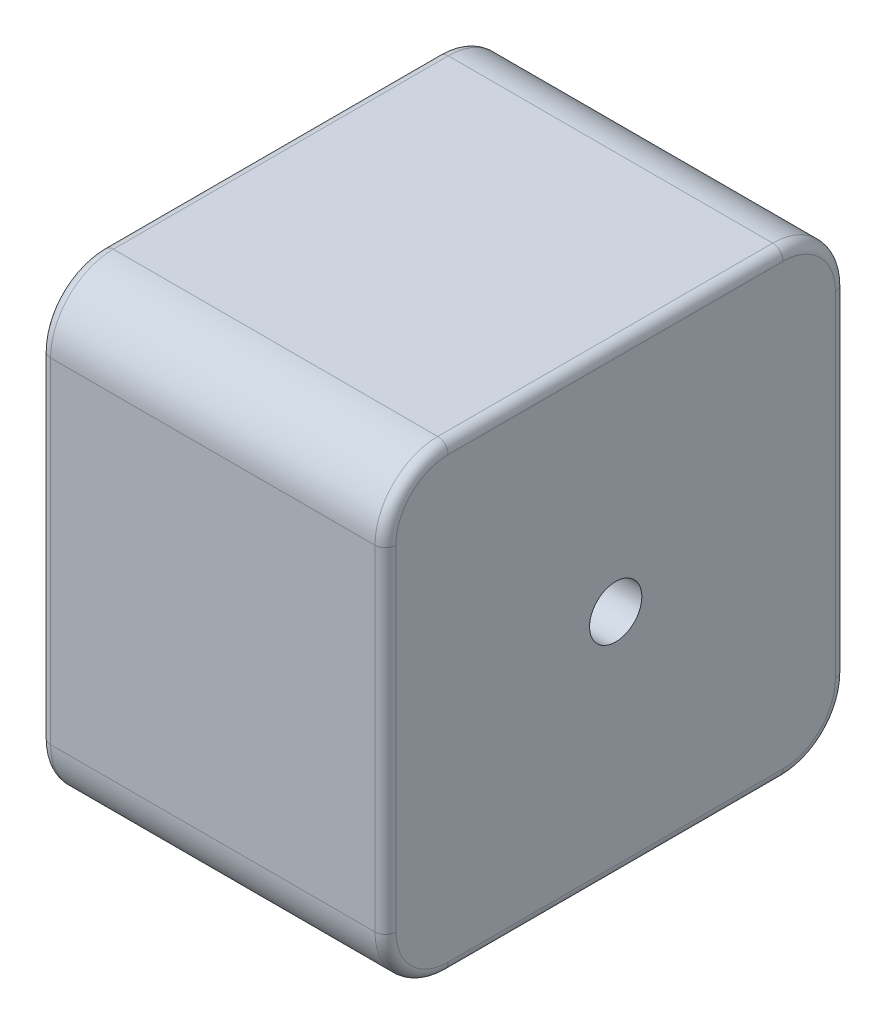
ISO-10303-21;
HEADER;
FILE_DESCRIPTION(('STEP AP214'),'2;1');
FILE_NAME('part.step','',(''),(''),'','','');
FILE_SCHEMA(('AUTOMOTIVE_DESIGN { 1 0 10303 214 1 1 1 1 }'));
ENDSEC;
DATA;
#1=APPLICATION_CONTEXT('core data for automotive mechanical design processes');
#2=APPLICATION_PROTOCOL_DEFINITION('international standard','automotive_design',2000,#1);
#3=PRODUCT_CONTEXT('',#1,'mechanical');
#4=PRODUCT('Part','Part','',(#3));
#5=PRODUCT_RELATED_PRODUCT_CATEGORY('part','',(#4));
#6=PRODUCT_DEFINITION_FORMATION('','',#4);
#7=PRODUCT_DEFINITION_CONTEXT('part definition',#1,'design');
#8=PRODUCT_DEFINITION('design','',#6,#7);
#9=PRODUCT_DEFINITION_SHAPE('','',#8);
#10=(LENGTH_UNIT() NAMED_UNIT(*) SI_UNIT(.MILLI.,.METRE.));
#11=(NAMED_UNIT(*) PLANE_ANGLE_UNIT() SI_UNIT($,.RADIAN.));
#12=(NAMED_UNIT(*) SI_UNIT($,.STERADIAN.) SOLID_ANGLE_UNIT());
#13=UNCERTAINTY_MEASURE_WITH_UNIT(LENGTH_MEASURE(1.E-05),#10,'distance_accuracy_value','');
#14=(GEOMETRIC_REPRESENTATION_CONTEXT(3) GLOBAL_UNCERTAINTY_ASSIGNED_CONTEXT((#13)) GLOBAL_UNIT_ASSIGNED_CONTEXT((#10,
#11,#12)) REPRESENTATION_CONTEXT('',''));
#15=CARTESIAN_POINT('',(0.,0.,0.));
#16=DIRECTION('',(0.,0.,1.));
#17=DIRECTION('',(1.,0.,0.));
#18=AXIS2_PLACEMENT_3D('',#15,#16,#17);
#19=CARTESIAN_POINT('',(33.,-16.,16.));
#20=DIRECTION('',(1.,0.,0.));
#21=DIRECTION('',(0.,0.,-1.));
#22=AXIS2_PLACEMENT_3D('',#19,#20,#21);
#23=PLANE('',#22);
#24=DIRECTION('',(0.,0.,1.));
#25=VECTOR('',#24,1.);
#26=CARTESIAN_POINT('',(33.,21.,16.));
#27=LINE('',#26,#25);
#28=CARTESIAN_POINT('',(33.,21.,-16.));
#29=VERTEX_POINT('',#28);
#30=CARTESIAN_POINT('',(33.,21.,16.));
#31=VERTEX_POINT('',#30);
#32=EDGE_CURVE('E268',#29,#31,#27,.T.);
#33=ORIENTED_EDGE('',*,*,#32,.T.);
#34=CARTESIAN_POINT('',(33.,16.,16.));
#35=DIRECTION('',(1.,0.,0.));
#36=DIRECTION('',(0.,0.,-1.));
#37=AXIS2_PLACEMENT_3D('',#34,#35,#36);
#38=CIRCLE('',#37,5.);
#39=CARTESIAN_POINT('',(33.,16.,21.));
#40=VERTEX_POINT('',#39);
#41=EDGE_CURVE('E247',#31,#40,#38,.T.);
#42=ORIENTED_EDGE('',*,*,#41,.T.);
#43=DIRECTION('',(0.,-1.,0.));
#44=VECTOR('',#43,1.);
#45=CARTESIAN_POINT('',(33.,-16.,21.));
#46=LINE('',#45,#44);
#47=CARTESIAN_POINT('',(33.,-16.,21.));
#48=VERTEX_POINT('',#47);
#49=EDGE_CURVE('E251',#40,#48,#46,.T.);
#50=ORIENTED_EDGE('',*,*,#49,.T.);
#51=CARTESIAN_POINT('',(33.,-16.,16.));
#52=DIRECTION('',(1.,0.,0.));
#53=DIRECTION('',(0.,0.,-1.));
#54=AXIS2_PLACEMENT_3D('',#51,#52,#53);
#55=CIRCLE('',#54,5.);
#56=CARTESIAN_POINT('',(33.,-21.,16.));
#57=VERTEX_POINT('',#56);
#58=EDGE_CURVE('E254',#48,#57,#55,.T.);
#59=ORIENTED_EDGE('',*,*,#58,.T.);
#60=DIRECTION('',(0.,0.,-1.));
#61=VECTOR('',#60,1.);
#62=CARTESIAN_POINT('',(33.,-21.,-16.));
#63=LINE('',#62,#61);
#64=CARTESIAN_POINT('',(33.,-21.,-16.));
#65=VERTEX_POINT('',#64);
#66=EDGE_CURVE('E257',#57,#65,#63,.T.);
#67=ORIENTED_EDGE('',*,*,#66,.T.);
#68=CARTESIAN_POINT('',(33.,-16.,-16.));
#69=DIRECTION('',(1.,0.,0.));
#70=DIRECTION('',(0.,0.,-1.));
#71=AXIS2_PLACEMENT_3D('',#68,#69,#70);
#72=CIRCLE('',#71,5.);
#73=CARTESIAN_POINT('',(33.,-16.,-21.));
#74=VERTEX_POINT('',#73);
#75=EDGE_CURVE('E260',#65,#74,#72,.T.);
#76=ORIENTED_EDGE('',*,*,#75,.T.);
#77=DIRECTION('',(0.,1.,0.));
#78=VECTOR('',#77,1.);
#79=CARTESIAN_POINT('',(33.,16.,-21.));
#80=LINE('',#79,#78);
#81=CARTESIAN_POINT('',(33.,16.,-21.));
#82=VERTEX_POINT('',#81);
#83=EDGE_CURVE('E263',#74,#82,#80,.T.);
#84=ORIENTED_EDGE('',*,*,#83,.T.);
#85=CARTESIAN_POINT('',(33.,16.,-16.));
#86=DIRECTION('',(1.,0.,0.));
#87=DIRECTION('',(0.,0.,-1.));
#88=AXIS2_PLACEMENT_3D('',#85,#86,#87);
#89=CIRCLE('',#88,5.);
#90=EDGE_CURVE('E188',#82,#29,#89,.T.);
#91=ORIENTED_EDGE('',*,*,#90,.T.);
#92=EDGE_LOOP('',(#33,#42,#50,#59,#67,#76,#84,#91));
#93=FACE_BOUND('',#92,.T.);
#94=CARTESIAN_POINT('',(33.,0.,0.));
#95=DIRECTION('',(1.,0.,0.));
#96=DIRECTION('',(0.,0.,-1.));
#97=AXIS2_PLACEMENT_3D('',#94,#95,#96);
#98=CIRCLE('',#97,2.5);
#99=CARTESIAN_POINT('',(33.,0.,-2.5));
#100=VERTEX_POINT('',#99);
#101=EDGE_CURVE('E352',#100,#100,#98,.T.);
#102=ORIENTED_EDGE('',*,*,#101,.F.);
#103=EDGE_LOOP('',(#102));
#104=FACE_BOUND('',#103,.T.);
#105=ADVANCED_FACE('F39',(#93,#104),#23,.T.);
#106=CARTESIAN_POINT('',(0.,-16.,16.));
#107=DIRECTION('',(1.,0.,0.));
#108=DIRECTION('',(0.,0.,-1.));
#109=AXIS2_PLACEMENT_3D('',#106,#107,#108);
#110=PLANE('',#109);
#111=CARTESIAN_POINT('',(0.,16.,-16.));
#112=DIRECTION('',(1.,0.,0.));
#113=DIRECTION('',(0.,0.,-1.));
#114=AXIS2_PLACEMENT_3D('',#111,#112,#113);
#115=CIRCLE('',#114,5.);
#116=CARTESIAN_POINT('',(0.,21.,-16.));
#117=VERTEX_POINT('',#116);
#118=CARTESIAN_POINT('',(0.,16.,-21.));
#119=VERTEX_POINT('',#118);
#120=EDGE_CURVE('E324',#117,#119,#115,.F.);
#121=ORIENTED_EDGE('',*,*,#120,.T.);
#122=DIRECTION('',(0.,1.,0.));
#123=VECTOR('',#122,1.);
#124=CARTESIAN_POINT('',(0.,-16.,-21.));
#125=LINE('',#124,#123);
#126=CARTESIAN_POINT('',(0.,-16.,-21.));
#127=VERTEX_POINT('',#126);
#128=EDGE_CURVE('E302',#119,#127,#125,.F.);
#129=ORIENTED_EDGE('',*,*,#128,.T.);
#130=CARTESIAN_POINT('',(0.,-16.,-16.));
#131=DIRECTION('',(1.,0.,0.));
#132=DIRECTION('',(0.,0.,-1.));
#133=AXIS2_PLACEMENT_3D('',#130,#131,#132);
#134=CIRCLE('',#133,5.);
#135=CARTESIAN_POINT('',(0.,-21.,-16.));
#136=VERTEX_POINT('',#135);
#137=EDGE_CURVE('E306',#127,#136,#134,.F.);
#138=ORIENTED_EDGE('',*,*,#137,.T.);
#139=DIRECTION('',(0.,0.,-1.));
#140=VECTOR('',#139,1.);
#141=CARTESIAN_POINT('',(0.,-21.,16.));
#142=LINE('',#141,#140);
#143=CARTESIAN_POINT('',(0.,-21.,16.));
#144=VERTEX_POINT('',#143);
#145=EDGE_CURVE('E309',#136,#144,#142,.F.);
#146=ORIENTED_EDGE('',*,*,#145,.T.);
#147=CARTESIAN_POINT('',(0.,-16.,16.));
#148=DIRECTION('',(1.,0.,0.));
#149=DIRECTION('',(0.,0.,-1.));
#150=AXIS2_PLACEMENT_3D('',#147,#148,#149);
#151=CIRCLE('',#150,5.);
#152=CARTESIAN_POINT('',(0.,-16.,21.));
#153=VERTEX_POINT('',#152);
#154=EDGE_CURVE('E312',#144,#153,#151,.F.);
#155=ORIENTED_EDGE('',*,*,#154,.T.);
#156=DIRECTION('',(0.,-1.,0.));
#157=VECTOR('',#156,1.);
#158=CARTESIAN_POINT('',(0.,-16.,21.));
#159=LINE('',#158,#157);
#160=CARTESIAN_POINT('',(0.,16.,21.));
#161=VERTEX_POINT('',#160);
#162=EDGE_CURVE('E315',#153,#161,#159,.F.);
#163=ORIENTED_EDGE('',*,*,#162,.T.);
#164=CARTESIAN_POINT('',(0.,16.,16.));
#165=DIRECTION('',(1.,0.,0.));
#166=DIRECTION('',(0.,0.,-1.));
#167=AXIS2_PLACEMENT_3D('',#164,#165,#166);
#168=CIRCLE('',#167,5.);
#169=CARTESIAN_POINT('',(0.,21.,16.));
#170=VERTEX_POINT('',#169);
#171=EDGE_CURVE('E318',#161,#170,#168,.F.);
#172=ORIENTED_EDGE('',*,*,#171,.T.);
#173=DIRECTION('',(0.,0.,1.));
#174=VECTOR('',#173,1.);
#175=CARTESIAN_POINT('',(0.,21.,16.));
#176=LINE('',#175,#174);
#177=EDGE_CURVE('E321',#170,#117,#176,.F.);
#178=ORIENTED_EDGE('',*,*,#177,.T.);
#179=EDGE_LOOP('',(#121,#129,#138,#146,#155,#163,#172,#178));
#180=FACE_BOUND('',#179,.T.);
#181=CARTESIAN_POINT('',(0.,0.,0.));
#182=DIRECTION('',(1.,0.,0.));
#183=DIRECTION('',(0.,0.,-1.));
#184=AXIS2_PLACEMENT_3D('',#181,#182,#183);
#185=CIRCLE('',#184,2.5);
#186=CARTESIAN_POINT('',(0.,0.,-2.5));
#187=VERTEX_POINT('',#186);
#188=EDGE_CURVE('E216',#187,#187,#185,.T.);
#189=ORIENTED_EDGE('',*,*,#188,.T.);
#190=EDGE_LOOP('',(#189));
#191=FACE_BOUND('',#190,.T.);
#192=ADVANCED_FACE('F364',(#180,#191),#110,.F.);
#193=CARTESIAN_POINT('',(33.,-16.,16.));
#194=DIRECTION('',(-1.,0.,0.));
#195=DIRECTION('',(0.,0.,1.));
#196=AXIS2_PLACEMENT_3D('',#193,#194,#195);
#197=CYLINDRICAL_SURFACE('',#196,6.);
#198=DIRECTION('',(-1.,0.,0.));
#199=VECTOR('',#198,1.);
#200=CARTESIAN_POINT('',(33.,-16.,22.));
#201=LINE('',#200,#199);
#202=CARTESIAN_POINT('',(32.,-16.,22.));
#203=VERTEX_POINT('',#202);
#204=CARTESIAN_POINT('',(1.,-16.,22.));
#205=VERTEX_POINT('',#204);
#206=EDGE_CURVE('E348',#203,#205,#201,.T.);
#207=ORIENTED_EDGE('',*,*,#206,.T.);
#208=CARTESIAN_POINT('',(1.,-16.,16.));
#209=DIRECTION('',(1.,0.,0.));
#210=DIRECTION('',(0.,0.,-1.));
#211=AXIS2_PLACEMENT_3D('',#208,#209,#210);
#212=CIRCLE('',#211,6.);
#213=CARTESIAN_POINT('',(1.,-22.,16.));
#214=VERTEX_POINT('',#213);
#215=EDGE_CURVE('E284',#205,#214,#212,.T.);
#216=ORIENTED_EDGE('',*,*,#215,.T.);
#217=DIRECTION('',(-1.,0.,0.));
#218=VECTOR('',#217,1.);
#219=CARTESIAN_POINT('',(33.,-22.,16.));
#220=LINE('',#219,#218);
#221=CARTESIAN_POINT('',(32.,-22.,16.));
#222=VERTEX_POINT('',#221);
#223=EDGE_CURVE('E185',#222,#214,#220,.T.);
#224=ORIENTED_EDGE('',*,*,#223,.F.);
#225=CARTESIAN_POINT('',(32.,-16.,16.));
#226=DIRECTION('',(1.,0.,0.));
#227=DIRECTION('',(0.,0.,-1.));
#228=AXIS2_PLACEMENT_3D('',#225,#226,#227);
#229=CIRCLE('',#228,6.);
#230=EDGE_CURVE('E287',#222,#203,#229,.F.);
#231=ORIENTED_EDGE('',*,*,#230,.T.);
#232=EDGE_LOOP('',(#207,#216,#224,#231));
#233=FACE_BOUND('',#232,.T.);
#234=ADVANCED_FACE('F370',(#233),#197,.T.);
#235=CARTESIAN_POINT('',(33.,-22.,16.));
#236=DIRECTION('',(0.,1.,0.));
#237=DIRECTION('',(0.,0.,1.));
#238=AXIS2_PLACEMENT_3D('',#235,#236,#237);
#239=PLANE('',#238);
#240=ORIENTED_EDGE('',*,*,#223,.T.);
#241=DIRECTION('',(0.,0.,-1.));
#242=VECTOR('',#241,1.);
#243=CARTESIAN_POINT('',(1.,-22.,16.));
#244=LINE('',#243,#242);
#245=CARTESIAN_POINT('',(1.,-22.,-16.));
#246=VERTEX_POINT('',#245);
#247=EDGE_CURVE('E290',#214,#246,#244,.T.);
#248=ORIENTED_EDGE('',*,*,#247,.T.);
#249=DIRECTION('',(-1.,0.,0.));
#250=VECTOR('',#249,1.);
#251=CARTESIAN_POINT('',(33.,-22.,-16.));
#252=LINE('',#251,#250);
#253=CARTESIAN_POINT('',(32.,-22.,-16.));
#254=VERTEX_POINT('',#253);
#255=EDGE_CURVE('E332',#254,#246,#252,.T.);
#256=ORIENTED_EDGE('',*,*,#255,.F.);
#257=DIRECTION('',(0.,0.,-1.));
#258=VECTOR('',#257,1.);
#259=CARTESIAN_POINT('',(32.,-22.,16.));
#260=LINE('',#259,#258);
#261=EDGE_CURVE('E293',#254,#222,#260,.F.);
#262=ORIENTED_EDGE('',*,*,#261,.T.);
#263=EDGE_LOOP('',(#240,#248,#256,#262));
#264=FACE_BOUND('',#263,.T.);
#265=ADVANCED_FACE('F393',(#264),#239,.F.);
#266=CARTESIAN_POINT('',(33.,-16.,-16.));
#267=DIRECTION('',(-1.,0.,0.));
#268=DIRECTION('',(0.,0.,1.));
#269=AXIS2_PLACEMENT_3D('',#266,#267,#268);
#270=CYLINDRICAL_SURFACE('',#269,6.);
#271=ORIENTED_EDGE('',*,*,#255,.T.);
#272=CARTESIAN_POINT('',(1.,-16.,-16.));
#273=DIRECTION('',(1.,0.,0.));
#274=DIRECTION('',(0.,0.,-1.));
#275=AXIS2_PLACEMENT_3D('',#272,#273,#274);
#276=CIRCLE('',#275,6.);
#277=CARTESIAN_POINT('',(1.,-16.,-22.));
#278=VERTEX_POINT('',#277);
#279=EDGE_CURVE('E296',#246,#278,#276,.T.);
#280=ORIENTED_EDGE('',*,*,#279,.T.);
#281=DIRECTION('',(-1.,0.,0.));
#282=VECTOR('',#281,1.);
#283=CARTESIAN_POINT('',(33.,-16.,-22.));
#284=LINE('',#283,#282);
#285=CARTESIAN_POINT('',(32.,-16.,-22.));
#286=VERTEX_POINT('',#285);
#287=EDGE_CURVE('E174',#286,#278,#284,.T.);
#288=ORIENTED_EDGE('',*,*,#287,.F.);
#289=CARTESIAN_POINT('',(32.,-16.,-16.));
#290=DIRECTION('',(1.,0.,0.));
#291=DIRECTION('',(0.,0.,-1.));
#292=AXIS2_PLACEMENT_3D('',#289,#290,#291);
#293=CIRCLE('',#292,6.);
#294=EDGE_CURVE('E299',#286,#254,#293,.F.);
#295=ORIENTED_EDGE('',*,*,#294,.T.);
#296=EDGE_LOOP('',(#271,#280,#288,#295));
#297=FACE_BOUND('',#296,.T.);
#298=ADVANCED_FACE('F390',(#297),#270,.T.);
#299=CARTESIAN_POINT('',(33.,16.,-22.));
#300=DIRECTION('',(0.,0.,1.));
#301=DIRECTION('',(1.,0.,0.));
#302=AXIS2_PLACEMENT_3D('',#299,#300,#301);
#303=PLANE('',#302);
#304=ORIENTED_EDGE('',*,*,#287,.T.);
#305=DIRECTION('',(0.,1.,0.));
#306=VECTOR('',#305,1.);
#307=CARTESIAN_POINT('',(1.,16.,-22.));
#308=LINE('',#307,#306);
#309=CARTESIAN_POINT('',(1.,16.,-22.));
#310=VERTEX_POINT('',#309);
#311=EDGE_CURVE('E172',#278,#310,#308,.T.);
#312=ORIENTED_EDGE('',*,*,#311,.T.);
#313=DIRECTION('',(-1.,0.,0.));
#314=VECTOR('',#313,1.);
#315=CARTESIAN_POINT('',(33.,16.,-22.));
#316=LINE('',#315,#314);
#317=CARTESIAN_POINT('',(32.,16.,-22.));
#318=VERTEX_POINT('',#317);
#319=EDGE_CURVE('E155',#318,#310,#316,.T.);
#320=ORIENTED_EDGE('',*,*,#319,.F.);
#321=DIRECTION('',(0.,1.,0.));
#322=VECTOR('',#321,1.);
#323=CARTESIAN_POINT('',(32.,-16.,-22.));
#324=LINE('',#323,#322);
#325=EDGE_CURVE('E169',#318,#286,#324,.F.);
#326=ORIENTED_EDGE('',*,*,#325,.T.);
#327=EDGE_LOOP('',(#304,#312,#320,#326));
#328=FACE_BOUND('',#327,.T.);
#329=ADVANCED_FACE('F168',(#328),#303,.F.);
#330=CARTESIAN_POINT('',(33.,16.,-16.));
#331=DIRECTION('',(-1.,0.,0.));
#332=DIRECTION('',(0.,0.,1.));
#333=AXIS2_PLACEMENT_3D('',#330,#331,#332);
#334=CYLINDRICAL_SURFACE('',#333,6.);
#335=ORIENTED_EDGE('',*,*,#319,.T.);
#336=CARTESIAN_POINT('',(1.,16.,-16.));
#337=DIRECTION('',(1.,0.,0.));
#338=DIRECTION('',(0.,0.,-1.));
#339=AXIS2_PLACEMENT_3D('',#336,#337,#338);
#340=CIRCLE('',#339,6.);
#341=CARTESIAN_POINT('',(1.,22.,-16.));
#342=VERTEX_POINT('',#341);
#343=EDGE_CURVE('E11',#310,#342,#340,.T.);
#344=ORIENTED_EDGE('',*,*,#343,.T.);
#345=DIRECTION('',(-1.,0.,0.));
#346=VECTOR('',#345,1.);
#347=CARTESIAN_POINT('',(33.,22.,-16.));
#348=LINE('',#347,#346);
#349=CARTESIAN_POINT('',(32.,22.,-16.));
#350=VERTEX_POINT('',#349);
#351=EDGE_CURVE('E156',#350,#342,#348,.T.);
#352=ORIENTED_EDGE('',*,*,#351,.F.);
#353=CARTESIAN_POINT('',(32.,16.,-16.));
#354=DIRECTION('',(1.,0.,0.));
#355=DIRECTION('',(0.,0.,-1.));
#356=AXIS2_PLACEMENT_3D('',#353,#354,#355);
#357=CIRCLE('',#356,6.);
#358=EDGE_CURVE('E49',#350,#318,#357,.F.);
#359=ORIENTED_EDGE('',*,*,#358,.T.);
#360=EDGE_LOOP('',(#335,#344,#352,#359));
#361=FACE_BOUND('',#360,.T.);
#362=ADVANCED_FACE('F154',(#361),#334,.T.);
#363=CARTESIAN_POINT('',(33.,22.,16.));
#364=DIRECTION('',(0.,-1.,0.));
#365=DIRECTION('',(0.,0.,-1.));
#366=AXIS2_PLACEMENT_3D('',#363,#364,#365);
#367=PLANE('',#366);
#368=ORIENTED_EDGE('',*,*,#351,.T.);
#369=DIRECTION('',(0.,0.,1.));
#370=VECTOR('',#369,1.);
#371=CARTESIAN_POINT('',(1.,22.,16.));
#372=LINE('',#371,#370);
#373=CARTESIAN_POINT('',(1.,22.,16.));
#374=VERTEX_POINT('',#373);
#375=EDGE_CURVE('E162',#342,#374,#372,.T.);
#376=ORIENTED_EDGE('',*,*,#375,.T.);
#377=DIRECTION('',(-1.,0.,0.));
#378=VECTOR('',#377,1.);
#379=CARTESIAN_POINT('',(33.,22.,16.));
#380=LINE('',#379,#378);
#381=CARTESIAN_POINT('',(32.,22.,16.));
#382=VERTEX_POINT('',#381);
#383=EDGE_CURVE('E340',#382,#374,#380,.T.);
#384=ORIENTED_EDGE('',*,*,#383,.F.);
#385=DIRECTION('',(0.,0.,1.));
#386=VECTOR('',#385,1.);
#387=CARTESIAN_POINT('',(32.,22.,-16.));
#388=LINE('',#387,#386);
#389=EDGE_CURVE('E62',#382,#350,#388,.F.);
#390=ORIENTED_EDGE('',*,*,#389,.T.);
#391=EDGE_LOOP('',(#368,#376,#384,#390));
#392=FACE_BOUND('',#391,.T.);
#393=ADVANCED_FACE('F382',(#392),#367,.F.);
#394=CARTESIAN_POINT('',(33.,16.,16.));
#395=DIRECTION('',(-1.,0.,0.));
#396=DIRECTION('',(0.,0.,1.));
#397=AXIS2_PLACEMENT_3D('',#394,#395,#396);
#398=CYLINDRICAL_SURFACE('',#397,6.);
#399=ORIENTED_EDGE('',*,*,#383,.T.);
#400=CARTESIAN_POINT('',(1.,16.,16.));
#401=DIRECTION('',(1.,0.,0.));
#402=DIRECTION('',(0.,0.,-1.));
#403=AXIS2_PLACEMENT_3D('',#400,#401,#402);
#404=CIRCLE('',#403,6.);
#405=CARTESIAN_POINT('',(1.,16.,22.));
#406=VERTEX_POINT('',#405);
#407=EDGE_CURVE('E271',#374,#406,#404,.T.);
#408=ORIENTED_EDGE('',*,*,#407,.T.);
#409=DIRECTION('',(-1.,0.,0.));
#410=VECTOR('',#409,1.);
#411=CARTESIAN_POINT('',(33.,16.,22.));
#412=LINE('',#411,#410);
#413=CARTESIAN_POINT('',(32.,16.,22.));
#414=VERTEX_POINT('',#413);
#415=EDGE_CURVE('E344',#414,#406,#412,.T.);
#416=ORIENTED_EDGE('',*,*,#415,.F.);
#417=CARTESIAN_POINT('',(32.,16.,16.));
#418=DIRECTION('',(1.,0.,0.));
#419=DIRECTION('',(0.,0.,-1.));
#420=AXIS2_PLACEMENT_3D('',#417,#418,#419);
#421=CIRCLE('',#420,6.);
#422=EDGE_CURVE('E274',#414,#382,#421,.F.);
#423=ORIENTED_EDGE('',*,*,#422,.T.);
#424=EDGE_LOOP('',(#399,#408,#416,#423));
#425=FACE_BOUND('',#424,.T.);
#426=ADVANCED_FACE('F378',(#425),#398,.T.);
#427=CARTESIAN_POINT('',(33.,16.,22.));
#428=DIRECTION('',(0.,0.,-1.));
#429=DIRECTION('',(-1.,0.,0.));
#430=AXIS2_PLACEMENT_3D('',#427,#428,#429);
#431=PLANE('',#430);
#432=ORIENTED_EDGE('',*,*,#415,.T.);
#433=DIRECTION('',(0.,-1.,0.));
#434=VECTOR('',#433,1.);
#435=CARTESIAN_POINT('',(1.,16.,22.));
#436=LINE('',#435,#434);
#437=EDGE_CURVE('E278',#406,#205,#436,.T.);
#438=ORIENTED_EDGE('',*,*,#437,.T.);
#439=ORIENTED_EDGE('',*,*,#206,.F.);
#440=DIRECTION('',(0.,-1.,0.));
#441=VECTOR('',#440,1.);
#442=CARTESIAN_POINT('',(32.,16.,22.));
#443=LINE('',#442,#441);
#444=EDGE_CURVE('E281',#203,#414,#443,.F.);
#445=ORIENTED_EDGE('',*,*,#444,.T.);
#446=EDGE_LOOP('',(#432,#438,#439,#445));
#447=FACE_BOUND('',#446,.T.);
#448=ADVANCED_FACE('F375',(#447),#431,.F.);
#449=CARTESIAN_POINT('',(33.,0.,0.));
#450=DIRECTION('',(-1.,0.,0.));
#451=DIRECTION('',(0.,0.,1.));
#452=AXIS2_PLACEMENT_3D('',#449,#450,#451);
#453=CYLINDRICAL_SURFACE('',#452,2.5);
#454=ORIENTED_EDGE('',*,*,#101,.T.);
#455=EDGE_LOOP('',(#454));
#456=FACE_BOUND('',#455,.T.);
#457=ORIENTED_EDGE('',*,*,#188,.F.);
#458=EDGE_LOOP('',(#457));
#459=FACE_BOUND('',#458,.T.);
#460=ADVANCED_FACE('F360',(#456,#459),#453,.F.);
#461=CARTESIAN_POINT('',(1.,16.,21.));
#462=DIRECTION('',(0.,-1.,0.));
#463=DIRECTION('',(0.,0.,-1.));
#464=AXIS2_PLACEMENT_3D('',#461,#462,#463);
#465=CYLINDRICAL_SURFACE('',#464,1.);
#466=CARTESIAN_POINT('',(1.,16.,21.));
#467=DIRECTION('',(0.,1.,0.));
#468=DIRECTION('',(0.,0.,1.));
#469=AXIS2_PLACEMENT_3D('',#466,#467,#468);
#470=CIRCLE('',#469,1.);
#471=EDGE_CURVE('E217',#161,#406,#470,.T.);
#472=ORIENTED_EDGE('',*,*,#471,.F.);
#473=ORIENTED_EDGE('',*,*,#162,.F.);
#474=CARTESIAN_POINT('',(1.,-16.,21.));
#475=DIRECTION('',(0.,-1.,0.));
#476=DIRECTION('',(1.,0.,0.));
#477=AXIS2_PLACEMENT_3D('',#474,#475,#476);
#478=CIRCLE('',#477,1.);
#479=EDGE_CURVE('E212',#205,#153,#478,.T.);
#480=ORIENTED_EDGE('',*,*,#479,.F.);
#481=ORIENTED_EDGE('',*,*,#437,.F.);
#482=EDGE_LOOP('',(#472,#473,#480,#481));
#483=FACE_BOUND('',#482,.T.);
#484=ADVANCED_FACE('F428',(#483),#465,.T.);
#485=CARTESIAN_POINT('',(1.,-16.,16.));
#486=DIRECTION('',(1.,0.,0.));
#487=DIRECTION('',(0.,0.,-1.));
#488=AXIS2_PLACEMENT_3D('',#485,#486,#487);
#489=TOROIDAL_SURFACE('',#488,5.,1.);
#490=ORIENTED_EDGE('',*,*,#479,.T.);
#491=ORIENTED_EDGE('',*,*,#154,.F.);
#492=CARTESIAN_POINT('',(1.,-21.,16.));
#493=DIRECTION('',(0.,0.,-1.));
#494=DIRECTION('',(-1.,0.,0.));
#495=AXIS2_PLACEMENT_3D('',#492,#493,#494);
#496=CIRCLE('',#495,1.);
#497=EDGE_CURVE('E221',#214,#144,#496,.T.);
#498=ORIENTED_EDGE('',*,*,#497,.F.);
#499=ORIENTED_EDGE('',*,*,#215,.F.);
#500=EDGE_LOOP('',(#490,#491,#498,#499));
#501=FACE_BOUND('',#500,.T.);
#502=ADVANCED_FACE('F424',(#501),#489,.T.);
#503=CARTESIAN_POINT('',(1.,16.,16.));
#504=DIRECTION('',(1.,0.,0.));
#505=DIRECTION('',(0.,0.,-1.));
#506=AXIS2_PLACEMENT_3D('',#503,#504,#505);
#507=TOROIDAL_SURFACE('',#506,5.,1.);
#508=ORIENTED_EDGE('',*,*,#471,.T.);
#509=ORIENTED_EDGE('',*,*,#407,.F.);
#510=CARTESIAN_POINT('',(1.,21.,16.));
#511=DIRECTION('',(0.,0.,-1.));
#512=DIRECTION('',(0.,1.,0.));
#513=AXIS2_PLACEMENT_3D('',#510,#511,#512);
#514=CIRCLE('',#513,1.);
#515=EDGE_CURVE('E225',#170,#374,#514,.T.);
#516=ORIENTED_EDGE('',*,*,#515,.F.);
#517=ORIENTED_EDGE('',*,*,#171,.F.);
#518=EDGE_LOOP('',(#508,#509,#516,#517));
#519=FACE_BOUND('',#518,.T.);
#520=ADVANCED_FACE('F420',(#519),#507,.T.);
#521=CARTESIAN_POINT('',(1.,-21.,16.));
#522=DIRECTION('',(0.,0.,-1.));
#523=DIRECTION('',(-1.,0.,0.));
#524=AXIS2_PLACEMENT_3D('',#521,#522,#523);
#525=CYLINDRICAL_SURFACE('',#524,1.);
#526=ORIENTED_EDGE('',*,*,#497,.T.);
#527=ORIENTED_EDGE('',*,*,#145,.F.);
#528=CARTESIAN_POINT('',(1.,-21.,-16.));
#529=DIRECTION('',(0.,0.,-1.));
#530=DIRECTION('',(-1.,0.,0.));
#531=AXIS2_PLACEMENT_3D('',#528,#529,#530);
#532=CIRCLE('',#531,1.);
#533=EDGE_CURVE('E229',#246,#136,#532,.T.);
#534=ORIENTED_EDGE('',*,*,#533,.F.);
#535=ORIENTED_EDGE('',*,*,#247,.F.);
#536=EDGE_LOOP('',(#526,#527,#534,#535));
#537=FACE_BOUND('',#536,.T.);
#538=ADVANCED_FACE('F416',(#537),#525,.T.);
#539=CARTESIAN_POINT('',(1.,21.,16.));
#540=DIRECTION('',(0.,0.,1.));
#541=DIRECTION('',(1.,0.,0.));
#542=AXIS2_PLACEMENT_3D('',#539,#540,#541);
#543=CYLINDRICAL_SURFACE('',#542,1.);
#544=ORIENTED_EDGE('',*,*,#515,.T.);
#545=ORIENTED_EDGE('',*,*,#375,.F.);
#546=CARTESIAN_POINT('',(1.,21.,-16.));
#547=DIRECTION('',(0.,0.,-1.));
#548=DIRECTION('',(-1.,0.,0.));
#549=AXIS2_PLACEMENT_3D('',#546,#547,#548);
#550=CIRCLE('',#549,1.);
#551=EDGE_CURVE('E233',#117,#342,#550,.T.);
#552=ORIENTED_EDGE('',*,*,#551,.F.);
#553=ORIENTED_EDGE('',*,*,#177,.F.);
#554=EDGE_LOOP('',(#544,#545,#552,#553));
#555=FACE_BOUND('',#554,.T.);
#556=ADVANCED_FACE('F412',(#555),#543,.T.);
#557=CARTESIAN_POINT('',(1.,-16.,-16.));
#558=DIRECTION('',(1.,0.,0.));
#559=DIRECTION('',(0.,0.,-1.));
#560=AXIS2_PLACEMENT_3D('',#557,#558,#559);
#561=TOROIDAL_SURFACE('',#560,5.,1.);
#562=ORIENTED_EDGE('',*,*,#533,.T.);
#563=ORIENTED_EDGE('',*,*,#137,.F.);
#564=CARTESIAN_POINT('',(1.,-16.,-21.));
#565=DIRECTION('',(0.,1.,0.));
#566=DIRECTION('',(0.,0.,1.));
#567=AXIS2_PLACEMENT_3D('',#564,#565,#566);
#568=CIRCLE('',#567,1.);
#569=EDGE_CURVE('E237',#278,#127,#568,.T.);
#570=ORIENTED_EDGE('',*,*,#569,.F.);
#571=ORIENTED_EDGE('',*,*,#279,.F.);
#572=EDGE_LOOP('',(#562,#563,#570,#571));
#573=FACE_BOUND('',#572,.T.);
#574=ADVANCED_FACE('F408',(#573),#561,.T.);
#575=CARTESIAN_POINT('',(1.,16.,-16.));
#576=DIRECTION('',(1.,0.,0.));
#577=DIRECTION('',(0.,0.,-1.));
#578=AXIS2_PLACEMENT_3D('',#575,#576,#577);
#579=TOROIDAL_SURFACE('',#578,5.,1.);
#580=ORIENTED_EDGE('',*,*,#551,.T.);
#581=ORIENTED_EDGE('',*,*,#343,.F.);
#582=CARTESIAN_POINT('',(1.,16.,-21.));
#583=DIRECTION('',(0.,-1.,0.));
#584=DIRECTION('',(0.,0.,-1.));
#585=AXIS2_PLACEMENT_3D('',#582,#583,#584);
#586=CIRCLE('',#585,1.);
#587=EDGE_CURVE('E240',#119,#310,#586,.T.);
#588=ORIENTED_EDGE('',*,*,#587,.F.);
#589=ORIENTED_EDGE('',*,*,#120,.F.);
#590=EDGE_LOOP('',(#580,#581,#588,#589));
#591=FACE_BOUND('',#590,.T.);
#592=ADVANCED_FACE('F404',(#591),#579,.T.);
#593=CARTESIAN_POINT('',(1.,16.,-21.));
#594=DIRECTION('',(0.,1.,0.));
#595=DIRECTION('',(0.,0.,1.));
#596=AXIS2_PLACEMENT_3D('',#593,#594,#595);
#597=CYLINDRICAL_SURFACE('',#596,1.);
#598=ORIENTED_EDGE('',*,*,#569,.T.);
#599=ORIENTED_EDGE('',*,*,#128,.F.);
#600=ORIENTED_EDGE('',*,*,#587,.T.);
#601=ORIENTED_EDGE('',*,*,#311,.F.);
#602=EDGE_LOOP('',(#598,#599,#600,#601));
#603=FACE_BOUND('',#602,.T.);
#604=ADVANCED_FACE('F401',(#603),#597,.T.);
#605=CARTESIAN_POINT('',(32.,-16.,-16.));
#606=DIRECTION('',(1.,0.,0.));
#607=DIRECTION('',(0.,0.,-1.));
#608=AXIS2_PLACEMENT_3D('',#605,#606,#607);
#609=TOROIDAL_SURFACE('',#608,5.,1.);
#610=CARTESIAN_POINT('',(32.,-21.,-16.));
#611=DIRECTION('',(0.,0.,1.));
#612=DIRECTION('',(1.,0.,0.));
#613=AXIS2_PLACEMENT_3D('',#610,#611,#612);
#614=CIRCLE('',#613,1.);
#615=EDGE_CURVE('E190',#254,#65,#614,.T.);
#616=ORIENTED_EDGE('',*,*,#615,.F.);
#617=ORIENTED_EDGE('',*,*,#294,.F.);
#618=CARTESIAN_POINT('',(32.,-16.,-21.));
#619=DIRECTION('',(0.,1.,0.));
#620=DIRECTION('',(0.,0.,1.));
#621=AXIS2_PLACEMENT_3D('',#618,#619,#620);
#622=CIRCLE('',#621,1.);
#623=EDGE_CURVE('E43',#74,#286,#622,.T.);
#624=ORIENTED_EDGE('',*,*,#623,.F.);
#625=ORIENTED_EDGE('',*,*,#75,.F.);
#626=EDGE_LOOP('',(#616,#617,#624,#625));
#627=FACE_BOUND('',#626,.T.);
#628=ADVANCED_FACE('F41',(#627),#609,.T.);
#629=CARTESIAN_POINT('',(32.,-16.,-21.));
#630=DIRECTION('',(0.,-1.,0.));
#631=DIRECTION('',(0.,0.,-1.));
#632=AXIS2_PLACEMENT_3D('',#629,#630,#631);
#633=CYLINDRICAL_SURFACE('',#632,1.);
#634=ORIENTED_EDGE('',*,*,#623,.T.);
#635=ORIENTED_EDGE('',*,*,#325,.F.);
#636=CARTESIAN_POINT('',(32.,16.,-21.));
#637=DIRECTION('',(0.,1.,0.));
#638=DIRECTION('',(0.,0.,1.));
#639=AXIS2_PLACEMENT_3D('',#636,#637,#638);
#640=CIRCLE('',#639,1.);
#641=EDGE_CURVE('E181',#82,#318,#640,.T.);
#642=ORIENTED_EDGE('',*,*,#641,.F.);
#643=ORIENTED_EDGE('',*,*,#83,.F.);
#644=EDGE_LOOP('',(#634,#635,#642,#643));
#645=FACE_BOUND('',#644,.T.);
#646=ADVANCED_FACE('F179',(#645),#633,.T.);
#647=CARTESIAN_POINT('',(32.,-21.,16.));
#648=DIRECTION('',(0.,0.,1.));
#649=DIRECTION('',(1.,0.,0.));
#650=AXIS2_PLACEMENT_3D('',#647,#648,#649);
#651=CYLINDRICAL_SURFACE('',#650,1.);
#652=ORIENTED_EDGE('',*,*,#615,.T.);
#653=ORIENTED_EDGE('',*,*,#66,.F.);
#654=CARTESIAN_POINT('',(32.,-21.,16.));
#655=DIRECTION('',(0.,0.,1.));
#656=DIRECTION('',(1.,0.,0.));
#657=AXIS2_PLACEMENT_3D('',#654,#655,#656);
#658=CIRCLE('',#657,1.);
#659=EDGE_CURVE('E191',#222,#57,#658,.T.);
#660=ORIENTED_EDGE('',*,*,#659,.F.);
#661=ORIENTED_EDGE('',*,*,#261,.F.);
#662=EDGE_LOOP('',(#652,#653,#660,#661));
#663=FACE_BOUND('',#662,.T.);
#664=ADVANCED_FACE('F451',(#663),#651,.T.);
#665=CARTESIAN_POINT('',(32.,16.,-16.));
#666=DIRECTION('',(1.,0.,0.));
#667=DIRECTION('',(0.,0.,-1.));
#668=AXIS2_PLACEMENT_3D('',#665,#666,#667);
#669=TOROIDAL_SURFACE('',#668,5.,1.);
#670=ORIENTED_EDGE('',*,*,#641,.T.);
#671=ORIENTED_EDGE('',*,*,#358,.F.);
#672=CARTESIAN_POINT('',(32.,21.,-16.));
#673=DIRECTION('',(0.,0.,1.));
#674=DIRECTION('',(0.,-1.,0.));
#675=AXIS2_PLACEMENT_3D('',#672,#673,#674);
#676=CIRCLE('',#675,1.);
#677=EDGE_CURVE('E197',#29,#350,#676,.T.);
#678=ORIENTED_EDGE('',*,*,#677,.F.);
#679=ORIENTED_EDGE('',*,*,#90,.F.);
#680=EDGE_LOOP('',(#670,#671,#678,#679));
#681=FACE_BOUND('',#680,.T.);
#682=ADVANCED_FACE('F187',(#681),#669,.T.);
#683=CARTESIAN_POINT('',(32.,-16.,16.));
#684=DIRECTION('',(1.,0.,0.));
#685=DIRECTION('',(0.,0.,-1.));
#686=AXIS2_PLACEMENT_3D('',#683,#684,#685);
#687=TOROIDAL_SURFACE('',#686,5.,1.);
#688=ORIENTED_EDGE('',*,*,#659,.T.);
#689=ORIENTED_EDGE('',*,*,#58,.F.);
#690=CARTESIAN_POINT('',(32.,-16.,21.));
#691=DIRECTION('',(0.,1.,0.));
#692=DIRECTION('',(0.,0.,1.));
#693=AXIS2_PLACEMENT_3D('',#690,#691,#692);
#694=CIRCLE('',#693,1.);
#695=EDGE_CURVE('E202',#203,#48,#694,.T.);
#696=ORIENTED_EDGE('',*,*,#695,.F.);
#697=ORIENTED_EDGE('',*,*,#230,.F.);
#698=EDGE_LOOP('',(#688,#689,#696,#697));
#699=FACE_BOUND('',#698,.T.);
#700=ADVANCED_FACE('F444',(#699),#687,.T.);
#701=CARTESIAN_POINT('',(32.,21.,16.));
#702=DIRECTION('',(0.,0.,-1.));
#703=DIRECTION('',(-1.,0.,0.));
#704=AXIS2_PLACEMENT_3D('',#701,#702,#703);
#705=CYLINDRICAL_SURFACE('',#704,1.);
#706=ORIENTED_EDGE('',*,*,#677,.T.);
#707=ORIENTED_EDGE('',*,*,#389,.F.);
#708=CARTESIAN_POINT('',(32.,21.,16.));
#709=DIRECTION('',(0.,0.,1.));
#710=DIRECTION('',(0.,-1.,0.));
#711=AXIS2_PLACEMENT_3D('',#708,#709,#710);
#712=CIRCLE('',#711,1.);
#713=EDGE_CURVE('E206',#31,#382,#712,.T.);
#714=ORIENTED_EDGE('',*,*,#713,.F.);
#715=ORIENTED_EDGE('',*,*,#32,.F.);
#716=EDGE_LOOP('',(#706,#707,#714,#715));
#717=FACE_BOUND('',#716,.T.);
#718=ADVANCED_FACE('F440',(#717),#705,.T.);
#719=CARTESIAN_POINT('',(32.,-16.,21.));
#720=DIRECTION('',(0.,1.,0.));
#721=DIRECTION('',(0.,0.,1.));
#722=AXIS2_PLACEMENT_3D('',#719,#720,#721);
#723=CYLINDRICAL_SURFACE('',#722,1.);
#724=ORIENTED_EDGE('',*,*,#695,.T.);
#725=ORIENTED_EDGE('',*,*,#49,.F.);
#726=CARTESIAN_POINT('',(32.,16.,21.));
#727=DIRECTION('',(0.,1.,0.));
#728=DIRECTION('',(-1.,0.,0.));
#729=AXIS2_PLACEMENT_3D('',#726,#727,#728);
#730=CIRCLE('',#729,1.);
#731=EDGE_CURVE('E209',#414,#40,#730,.T.);
#732=ORIENTED_EDGE('',*,*,#731,.F.);
#733=ORIENTED_EDGE('',*,*,#444,.F.);
#734=EDGE_LOOP('',(#724,#725,#732,#733));
#735=FACE_BOUND('',#734,.T.);
#736=ADVANCED_FACE('F436',(#735),#723,.T.);
#737=CARTESIAN_POINT('',(32.,16.,16.));
#738=DIRECTION('',(1.,0.,0.));
#739=DIRECTION('',(0.,0.,-1.));
#740=AXIS2_PLACEMENT_3D('',#737,#738,#739);
#741=TOROIDAL_SURFACE('',#740,5.,1.);
#742=ORIENTED_EDGE('',*,*,#713,.T.);
#743=ORIENTED_EDGE('',*,*,#422,.F.);
#744=ORIENTED_EDGE('',*,*,#731,.T.);
#745=ORIENTED_EDGE('',*,*,#41,.F.);
#746=EDGE_LOOP('',(#742,#743,#744,#745));
#747=FACE_BOUND('',#746,.T.);
#748=ADVANCED_FACE('F433',(#747),#741,.T.);
#749=CLOSED_SHELL('',(#105,#192,#234,#265,#298,#329,#362,#393,#426,#448,#460,#484,#502,#520,
#538,#556,#574,#592,#604,#628,#646,#664,#682,#700,#718,#736,#748));
#750=MANIFOLD_SOLID_BREP('B2',#749);
#751=ADVANCED_BREP_SHAPE_REPRESENTATION('',(#18,#750),#14);
#752=SHAPE_DEFINITION_REPRESENTATION(#9,#751);
ENDSEC;
END-ISO-10303-21;
